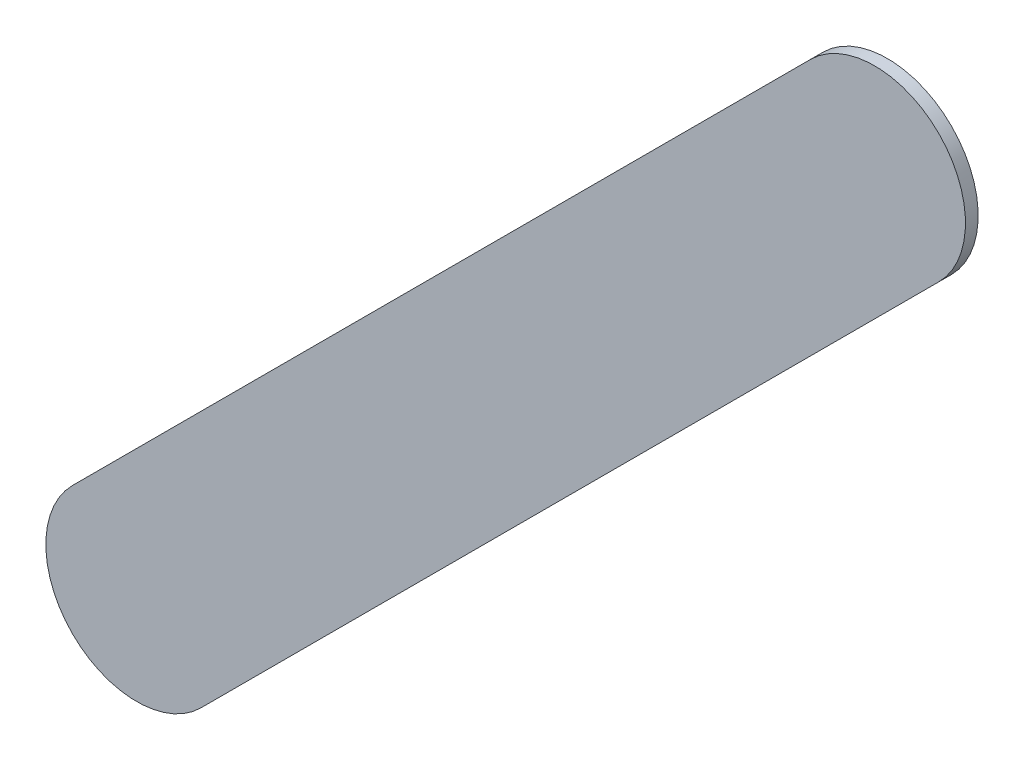
ISO-10303-21;
HEADER;
FILE_DESCRIPTION(('STEP AP214'),'2;1');
FILE_NAME('part.step','',(''),(''),'','','');
FILE_SCHEMA(('AUTOMOTIVE_DESIGN { 1 0 10303 214 1 1 1 1 }'));
ENDSEC;
DATA;
#1=APPLICATION_CONTEXT('core data for automotive mechanical design processes');
#2=APPLICATION_PROTOCOL_DEFINITION('international standard','automotive_design',2000,#1);
#3=PRODUCT_CONTEXT('',#1,'mechanical');
#4=PRODUCT('Part','Part','',(#3));
#5=PRODUCT_RELATED_PRODUCT_CATEGORY('part','',(#4));
#6=PRODUCT_DEFINITION_FORMATION('','',#4);
#7=PRODUCT_DEFINITION_CONTEXT('part definition',#1,'design');
#8=PRODUCT_DEFINITION('design','',#6,#7);
#9=PRODUCT_DEFINITION_SHAPE('','',#8);
#10=(LENGTH_UNIT() NAMED_UNIT(*) SI_UNIT(.MILLI.,.METRE.));
#11=(NAMED_UNIT(*) PLANE_ANGLE_UNIT() SI_UNIT($,.RADIAN.));
#12=(NAMED_UNIT(*) SI_UNIT($,.STERADIAN.) SOLID_ANGLE_UNIT());
#13=UNCERTAINTY_MEASURE_WITH_UNIT(LENGTH_MEASURE(1.E-05),#10,'distance_accuracy_value','');
#14=(GEOMETRIC_REPRESENTATION_CONTEXT(3) GLOBAL_UNCERTAINTY_ASSIGNED_CONTEXT((#13)) GLOBAL_UNIT_ASSIGNED_CONTEXT((#10,
#11,#12)) REPRESENTATION_CONTEXT('',''));
#15=CARTESIAN_POINT('',(0.,0.,0.));
#16=DIRECTION('',(0.,0.,1.));
#17=DIRECTION('',(1.,0.,0.));
#18=AXIS2_PLACEMENT_3D('',#15,#16,#17);
#19=CARTESIAN_POINT('',(137.844776,-107.364776,0.));
#20=DIRECTION('',(0.,0.,1.));
#21=DIRECTION('',(1.,0.,0.));
#22=AXIS2_PLACEMENT_3D('',#19,#20,#21);
#23=PLANE('',#22);
#24=DIRECTION('',(0.707106781186548,0.707106781186548,0.));
#25=VECTOR('',#24,1.);
#26=CARTESIAN_POINT('',(137.844776,-107.364776,0.));
#27=LINE('',#26,#25);
#28=CARTESIAN_POINT('',(137.844776,-107.364776,0.));
#29=VERTEX_POINT('',#28);
#30=CARTESIAN_POINT('',(139.876776,-105.332776,0.));
#31=VERTEX_POINT('',#30);
#32=EDGE_CURVE('E91',#29,#31,#27,.T.);
#33=ORIENTED_EDGE('',*,*,#32,.T.);
#34=CARTESIAN_POINT('',(139.6999995,-105.1559995,0.));
#35=DIRECTION('',(0.,0.,1.));
#36=DIRECTION('',(0.707106781187048,-0.707106781186048,0.));
#37=AXIS2_PLACEMENT_3D('',#34,#35,#36);
#38=CIRCLE('',#37,0.249999723809);
#39=CARTESIAN_POINT('',(139.523223,-104.979223,0.));
#40=VERTEX_POINT('',#39);
#41=EDGE_CURVE('E69',#31,#40,#38,.T.);
#42=ORIENTED_EDGE('',*,*,#41,.T.);
#43=DIRECTION('',(-0.707106781186548,-0.707106781186548,0.));
#44=VECTOR('',#43,1.);
#45=CARTESIAN_POINT('',(139.523223,-104.979223,0.));
#46=LINE('',#45,#44);
#47=CARTESIAN_POINT('',(137.491223,-107.011223,0.));
#48=VERTEX_POINT('',#47);
#49=EDGE_CURVE('E74',#40,#48,#46,.T.);
#50=ORIENTED_EDGE('',*,*,#49,.T.);
#51=CARTESIAN_POINT('',(137.6679995,-107.1879995,0.));
#52=DIRECTION('',(0.,0.,1.));
#53=DIRECTION('',(-0.707106781186548,0.707106781186548,0.));
#54=AXIS2_PLACEMENT_3D('',#51,#52,#53);
#55=CIRCLE('',#54,0.249999723809);
#56=EDGE_CURVE('E11',#48,#29,#55,.T.);
#57=ORIENTED_EDGE('',*,*,#56,.T.);
#58=EDGE_LOOP('',(#33,#42,#50,#57));
#59=FACE_BOUND('',#58,.T.);
#60=ADVANCED_FACE('F17',(#59),#23,.T.);
#61=CARTESIAN_POINT('',(137.844776,-107.364776,-0.035));
#62=DIRECTION('',(0.,0.,1.));
#63=DIRECTION('',(1.,0.,0.));
#64=AXIS2_PLACEMENT_3D('',#61,#62,#63);
#65=PLANE('',#64);
#66=CARTESIAN_POINT('',(137.6679995,-107.1879995,-0.035));
#67=DIRECTION('',(0.,0.,1.));
#68=DIRECTION('',(-0.707106781186548,0.707106781186548,0.));
#69=AXIS2_PLACEMENT_3D('',#66,#67,#68);
#70=CIRCLE('',#69,0.249999723809);
#71=CARTESIAN_POINT('',(137.491223,-107.011223,-0.035));
#72=VERTEX_POINT('',#71);
#73=CARTESIAN_POINT('',(137.844776,-107.364776,-0.035));
#74=VERTEX_POINT('',#73);
#75=EDGE_CURVE('E26',#72,#74,#70,.T.);
#76=ORIENTED_EDGE('',*,*,#75,.F.);
#77=DIRECTION('',(-0.707106781186548,-0.707106781186548,0.));
#78=VECTOR('',#77,1.);
#79=CARTESIAN_POINT('',(139.523223,-104.979223,-0.035));
#80=LINE('',#79,#78);
#81=CARTESIAN_POINT('',(139.523223,-104.979223,-0.035));
#82=VERTEX_POINT('',#81);
#83=EDGE_CURVE('E56',#82,#72,#80,.T.);
#84=ORIENTED_EDGE('',*,*,#83,.F.);
#85=CARTESIAN_POINT('',(139.6999995,-105.1559995,-0.035));
#86=DIRECTION('',(0.,0.,1.));
#87=DIRECTION('',(0.707106781187048,-0.707106781186048,0.));
#88=AXIS2_PLACEMENT_3D('',#85,#86,#87);
#89=CIRCLE('',#88,0.249999723809);
#90=CARTESIAN_POINT('',(139.876776,-105.332776,-0.035));
#91=VERTEX_POINT('',#90);
#92=EDGE_CURVE('E62',#91,#82,#89,.T.);
#93=ORIENTED_EDGE('',*,*,#92,.F.);
#94=DIRECTION('',(0.707106781186548,0.707106781186548,0.));
#95=VECTOR('',#94,1.);
#96=CARTESIAN_POINT('',(137.844776,-107.364776,-0.035));
#97=LINE('',#96,#95);
#98=EDGE_CURVE('E108',#74,#91,#97,.T.);
#99=ORIENTED_EDGE('',*,*,#98,.F.);
#100=EDGE_LOOP('',(#76,#84,#93,#99));
#101=FACE_BOUND('',#100,.T.);
#102=ADVANCED_FACE('F58',(#101),#65,.F.);
#103=CARTESIAN_POINT('',(137.6679995,-107.1879995,-0.035));
#104=DIRECTION('',(0.,0.,-1.));
#105=DIRECTION('',(-0.707106781186548,0.707106781186548,0.));
#106=AXIS2_PLACEMENT_3D('',#103,#104,#105);
#107=CYLINDRICAL_SURFACE('',#106,0.249999723809);
#108=ORIENTED_EDGE('',*,*,#75,.T.);
#109=DIRECTION('',(0.,0.,1.));
#110=VECTOR('',#109,1.);
#111=CARTESIAN_POINT('',(137.844776,-107.364776,-0.035));
#112=LINE('',#111,#110);
#113=EDGE_CURVE('E85',#74,#29,#112,.T.);
#114=ORIENTED_EDGE('',*,*,#113,.T.);
#115=ORIENTED_EDGE('',*,*,#56,.F.);
#116=DIRECTION('',(0.,0.,1.));
#117=VECTOR('',#116,1.);
#118=CARTESIAN_POINT('',(137.491223,-107.011223,-0.035));
#119=LINE('',#118,#117);
#120=EDGE_CURVE('E68',#72,#48,#119,.T.);
#121=ORIENTED_EDGE('',*,*,#120,.F.);
#122=EDGE_LOOP('',(#108,#114,#115,#121));
#123=FACE_BOUND('',#122,.T.);
#124=ADVANCED_FACE('F169',(#123),#107,.T.);
#125=CARTESIAN_POINT('',(139.523223,-104.979223,-0.035));
#126=DIRECTION('',(0.707106781186548,-0.707106781186548,0.));
#127=DIRECTION('',(0.,0.,-1.));
#128=AXIS2_PLACEMENT_3D('',#125,#126,#127);
#129=PLANE('',#128);
#130=ORIENTED_EDGE('',*,*,#83,.T.);
#131=ORIENTED_EDGE('',*,*,#120,.T.);
#132=ORIENTED_EDGE('',*,*,#49,.F.);
#133=DIRECTION('',(0.,0.,1.));
#134=VECTOR('',#133,1.);
#135=CARTESIAN_POINT('',(139.523223,-104.979223,-0.035));
#136=LINE('',#135,#134);
#137=EDGE_CURVE('E72',#82,#40,#136,.T.);
#138=ORIENTED_EDGE('',*,*,#137,.F.);
#139=EDGE_LOOP('',(#130,#131,#132,#138));
#140=FACE_BOUND('',#139,.T.);
#141=ADVANCED_FACE('F73',(#140),#129,.F.);
#142=CARTESIAN_POINT('',(139.6999995,-105.1559995,-0.035));
#143=DIRECTION('',(0.,0.,-1.));
#144=DIRECTION('',(0.707106781187048,-0.707106781186048,0.));
#145=AXIS2_PLACEMENT_3D('',#142,#143,#144);
#146=CYLINDRICAL_SURFACE('',#145,0.249999723809);
#147=ORIENTED_EDGE('',*,*,#92,.T.);
#148=ORIENTED_EDGE('',*,*,#137,.T.);
#149=ORIENTED_EDGE('',*,*,#41,.F.);
#150=DIRECTION('',(0.,0.,1.));
#151=VECTOR('',#150,1.);
#152=CARTESIAN_POINT('',(139.876776,-105.332776,-0.035));
#153=LINE('',#152,#151);
#154=EDGE_CURVE('E82',#91,#31,#153,.T.);
#155=ORIENTED_EDGE('',*,*,#154,.F.);
#156=EDGE_LOOP('',(#147,#148,#149,#155));
#157=FACE_BOUND('',#156,.T.);
#158=ADVANCED_FACE('F80',(#157),#146,.T.);
#159=CARTESIAN_POINT('',(137.844776,-107.364776,-0.035));
#160=DIRECTION('',(-0.707106781186548,0.707106781186548,0.));
#161=DIRECTION('',(0.,0.,1.));
#162=AXIS2_PLACEMENT_3D('',#159,#160,#161);
#163=PLANE('',#162);
#164=ORIENTED_EDGE('',*,*,#98,.T.);
#165=ORIENTED_EDGE('',*,*,#154,.T.);
#166=ORIENTED_EDGE('',*,*,#32,.F.);
#167=ORIENTED_EDGE('',*,*,#113,.F.);
#168=EDGE_LOOP('',(#164,#165,#166,#167));
#169=FACE_BOUND('',#168,.T.);
#170=ADVANCED_FACE('F118',(#169),#163,.F.);
#171=CLOSED_SHELL('',(#60,#102,#124,#141,#158,#170));
#172=MANIFOLD_SOLID_BREP('B1',#171);
#173=ADVANCED_BREP_SHAPE_REPRESENTATION('',(#18,#172),#14);
#174=SHAPE_DEFINITION_REPRESENTATION(#9,#173);
ENDSEC;
END-ISO-10303-21;
